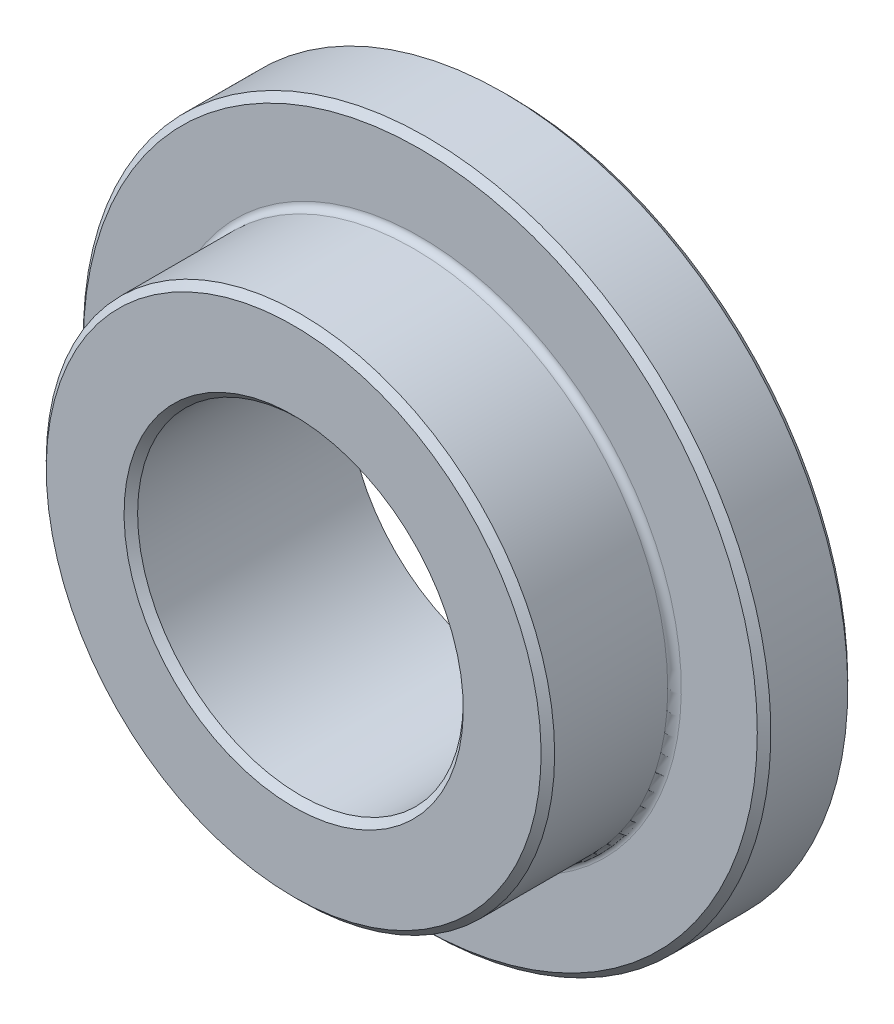
ISO-10303-21;
HEADER;
FILE_DESCRIPTION(('STEP AP214'),'2;1');
FILE_NAME('part.step','',(''),(''),'','','');
FILE_SCHEMA(('AUTOMOTIVE_DESIGN { 1 0 10303 214 1 1 1 1 }'));
ENDSEC;
DATA;
#1=APPLICATION_CONTEXT('core data for automotive mechanical design processes');
#2=APPLICATION_PROTOCOL_DEFINITION('international standard','automotive_design',2000,#1);
#3=PRODUCT_CONTEXT('',#1,'mechanical');
#4=PRODUCT('Part','Part','',(#3));
#5=PRODUCT_RELATED_PRODUCT_CATEGORY('part','',(#4));
#6=PRODUCT_DEFINITION_FORMATION('','',#4);
#7=PRODUCT_DEFINITION_CONTEXT('part definition',#1,'design');
#8=PRODUCT_DEFINITION('design','',#6,#7);
#9=PRODUCT_DEFINITION_SHAPE('','',#8);
#10=(LENGTH_UNIT() NAMED_UNIT(*) SI_UNIT(.MILLI.,.METRE.));
#11=(NAMED_UNIT(*) PLANE_ANGLE_UNIT() SI_UNIT($,.RADIAN.));
#12=(NAMED_UNIT(*) SI_UNIT($,.STERADIAN.) SOLID_ANGLE_UNIT());
#13=UNCERTAINTY_MEASURE_WITH_UNIT(LENGTH_MEASURE(1.E-05),#10,'distance_accuracy_value','');
#14=(GEOMETRIC_REPRESENTATION_CONTEXT(3) GLOBAL_UNCERTAINTY_ASSIGNED_CONTEXT((#13)) GLOBAL_UNIT_ASSIGNED_CONTEXT((#10,
#11,#12)) REPRESENTATION_CONTEXT('',''));
#15=CARTESIAN_POINT('',(0.,0.,0.));
#16=DIRECTION('',(0.,0.,1.));
#17=DIRECTION('',(1.,0.,0.));
#18=AXIS2_PLACEMENT_3D('',#15,#16,#17);
#19=CARTESIAN_POINT('',(0.,9.5,-3.));
#20=DIRECTION('',(0.,0.,-1.));
#21=DIRECTION('',(0.,1.,0.));
#22=AXIS2_PLACEMENT_3D('',#19,#20,#21);
#23=PLANE('',#22);
#24=CARTESIAN_POINT('',(0.,0.,-3.));
#25=DIRECTION('',(0.,0.,-1.));
#26=DIRECTION('',(0.,1.,0.));
#27=AXIS2_PLACEMENT_3D('',#24,#25,#26);
#28=CIRCLE('',#27,9.3125);
#29=CARTESIAN_POINT('',(0.,9.3125,-3.));
#30=VERTEX_POINT('',#29);
#31=EDGE_CURVE('E83',#30,#30,#28,.T.);
#32=ORIENTED_EDGE('',*,*,#31,.T.);
#33=EDGE_LOOP('',(#32));
#34=FACE_BOUND('',#33,.T.);
#35=CARTESIAN_POINT('',(0.,0.,-3.));
#36=DIRECTION('',(0.,0.,-1.));
#37=DIRECTION('',(0.,1.,0.));
#38=AXIS2_PLACEMENT_3D('',#35,#36,#37);
#39=CIRCLE('',#38,4.5);
#40=CARTESIAN_POINT('',(0.,4.5,-3.));
#41=VERTEX_POINT('',#40);
#42=EDGE_CURVE('E87',#41,#41,#39,.T.);
#43=ORIENTED_EDGE('',*,*,#42,.F.);
#44=EDGE_LOOP('',(#43));
#45=FACE_BOUND('',#44,.T.);
#46=ADVANCED_FACE('F39',(#34,#45),#23,.T.);
#47=CARTESIAN_POINT('',(0.,0.,-3.));
#48=DIRECTION('',(0.,0.,-1.));
#49=DIRECTION('',(0.,1.,0.));
#50=AXIS2_PLACEMENT_3D('',#47,#48,#49);
#51=CYLINDRICAL_SURFACE('',#50,9.5);
#52=CARTESIAN_POINT('',(0.,0.,-2.8125));
#53=DIRECTION('',(0.,0.,-1.));
#54=DIRECTION('',(0.,1.,0.));
#55=AXIS2_PLACEMENT_3D('',#52,#53,#54);
#56=CIRCLE('',#55,9.5);
#57=CARTESIAN_POINT('',(0.,9.5,-2.8125));
#58=VERTEX_POINT('',#57);
#59=EDGE_CURVE('E75',#58,#58,#56,.F.);
#60=ORIENTED_EDGE('',*,*,#59,.T.);
#61=EDGE_LOOP('',(#60));
#62=FACE_BOUND('',#61,.T.);
#63=CARTESIAN_POINT('',(0.,0.,-0.687499999999996));
#64=DIRECTION('',(0.,0.,1.));
#65=DIRECTION('',(0.,-1.,0.));
#66=AXIS2_PLACEMENT_3D('',#63,#64,#65);
#67=CIRCLE('',#66,9.5);
#68=CARTESIAN_POINT('',(0.,-9.5,-0.687499999999997));
#69=VERTEX_POINT('',#68);
#70=EDGE_CURVE('E79',#69,#69,#67,.F.);
#71=ORIENTED_EDGE('',*,*,#70,.T.);
#72=EDGE_LOOP('',(#71));
#73=FACE_BOUND('',#72,.T.);
#74=ADVANCED_FACE('F95',(#62,#73),#51,.T.);
#75=CARTESIAN_POINT('',(0.,9.5,-0.499999999999999));
#76=DIRECTION('',(0.,0.,1.));
#77=DIRECTION('',(0.,-1.,0.));
#78=AXIS2_PLACEMENT_3D('',#75,#76,#77);
#79=PLANE('',#78);
#80=CARTESIAN_POINT('',(0.,0.,-0.500000000000001));
#81=DIRECTION('',(0.,0.,1.));
#82=DIRECTION('',(0.,-1.,0.));
#83=AXIS2_PLACEMENT_3D('',#80,#81,#82);
#84=CIRCLE('',#83,7.2125);
#85=CARTESIAN_POINT('',(0.,-7.2125,-0.500000000000002));
#86=VERTEX_POINT('',#85);
#87=EDGE_CURVE('E47',#86,#86,#84,.F.);
#88=ORIENTED_EDGE('',*,*,#87,.T.);
#89=EDGE_LOOP('',(#88));
#90=FACE_BOUND('',#89,.T.);
#91=CARTESIAN_POINT('',(0.,0.,-0.500000000000001));
#92=DIRECTION('',(0.,0.,1.));
#93=DIRECTION('',(0.,-1.,0.));
#94=AXIS2_PLACEMENT_3D('',#91,#92,#93);
#95=CIRCLE('',#94,9.31250000000001);
#96=CARTESIAN_POINT('',(0.,-9.31250000000001,-0.500000000000002));
#97=VERTEX_POINT('',#96);
#98=EDGE_CURVE('E71',#97,#97,#95,.T.);
#99=ORIENTED_EDGE('',*,*,#98,.T.);
#100=EDGE_LOOP('',(#99));
#101=FACE_BOUND('',#100,.T.);
#102=ADVANCED_FACE('F101',(#90,#101),#79,.T.);
#103=CARTESIAN_POINT('',(0.,0.,-3.));
#104=DIRECTION('',(0.,0.,-1.));
#105=DIRECTION('',(0.,1.,0.));
#106=AXIS2_PLACEMENT_3D('',#103,#104,#105);
#107=CYLINDRICAL_SURFACE('',#106,7.025);
#108=CARTESIAN_POINT('',(0.,0.,-0.312500000000001));
#109=DIRECTION('',(0.,0.,1.));
#110=DIRECTION('',(0.,-1.,0.));
#111=AXIS2_PLACEMENT_3D('',#108,#109,#110);
#112=CIRCLE('',#111,7.025);
#113=CARTESIAN_POINT('',(0.,-7.025,-0.312500000000002));
#114=VERTEX_POINT('',#113);
#115=EDGE_CURVE('E10',#114,#114,#112,.T.);
#116=ORIENTED_EDGE('',*,*,#115,.T.);
#117=EDGE_LOOP('',(#116));
#118=FACE_BOUND('',#117,.T.);
#119=CARTESIAN_POINT('',(0.,0.,2.8125));
#120=DIRECTION('',(0.,0.,1.));
#121=DIRECTION('',(0.,-1.,0.));
#122=AXIS2_PLACEMENT_3D('',#119,#120,#121);
#123=CIRCLE('',#122,7.025);
#124=CARTESIAN_POINT('',(0.,-7.025,2.8125));
#125=VERTEX_POINT('',#124);
#126=EDGE_CURVE('E67',#125,#125,#123,.F.);
#127=ORIENTED_EDGE('',*,*,#126,.T.);
#128=EDGE_LOOP('',(#127));
#129=FACE_BOUND('',#128,.T.);
#130=ADVANCED_FACE('F130',(#118,#129),#107,.T.);
#131=CARTESIAN_POINT('',(0.,7.025,3.));
#132=DIRECTION('',(0.,0.,1.));
#133=DIRECTION('',(0.,-1.,0.));
#134=AXIS2_PLACEMENT_3D('',#131,#132,#133);
#135=PLANE('',#134);
#136=CARTESIAN_POINT('',(0.,0.,3.));
#137=DIRECTION('',(0.,0.,1.));
#138=DIRECTION('',(0.,-1.,0.));
#139=AXIS2_PLACEMENT_3D('',#136,#137,#138);
#140=CIRCLE('',#139,6.8375);
#141=CARTESIAN_POINT('',(0.,-6.8375,3.));
#142=VERTEX_POINT('',#141);
#143=EDGE_CURVE('E57',#142,#142,#140,.T.);
#144=ORIENTED_EDGE('',*,*,#143,.T.);
#145=EDGE_LOOP('',(#144));
#146=FACE_BOUND('',#145,.T.);
#147=CARTESIAN_POINT('',(0.,0.,3.));
#148=DIRECTION('',(0.,0.,1.));
#149=DIRECTION('',(0.,-1.,0.));
#150=AXIS2_PLACEMENT_3D('',#147,#148,#149);
#151=CIRCLE('',#150,4.6875);
#152=CARTESIAN_POINT('',(0.,-4.6875,3.));
#153=VERTEX_POINT('',#152);
#154=EDGE_CURVE('E63',#153,#153,#151,.F.);
#155=ORIENTED_EDGE('',*,*,#154,.T.);
#156=EDGE_LOOP('',(#155));
#157=FACE_BOUND('',#156,.T.);
#158=ADVANCED_FACE('F128',(#146,#157),#135,.T.);
#159=CARTESIAN_POINT('',(0.,0.,-3.));
#160=DIRECTION('',(0.,0.,-1.));
#161=DIRECTION('',(0.,1.,0.));
#162=AXIS2_PLACEMENT_3D('',#159,#160,#161);
#163=CYLINDRICAL_SURFACE('',#162,4.5);
#164=CARTESIAN_POINT('',(0.,0.,2.8125));
#165=DIRECTION('',(0.,0.,1.));
#166=DIRECTION('',(0.,-1.,0.));
#167=AXIS2_PLACEMENT_3D('',#164,#165,#166);
#168=CIRCLE('',#167,4.5);
#169=CARTESIAN_POINT('',(0.,-4.5,2.8125));
#170=VERTEX_POINT('',#169);
#171=EDGE_CURVE('E52',#170,#170,#168,.T.);
#172=ORIENTED_EDGE('',*,*,#171,.T.);
#173=EDGE_LOOP('',(#172));
#174=FACE_BOUND('',#173,.T.);
#175=ORIENTED_EDGE('',*,*,#42,.T.);
#176=EDGE_LOOP('',(#175));
#177=FACE_BOUND('',#176,.T.);
#178=ADVANCED_FACE('F92',(#174,#177),#163,.F.);
#179=CARTESIAN_POINT('',(0.,0.,-3.));
#180=DIRECTION('',(0.,0.,1.));
#181=DIRECTION('',(0.,-1.,0.));
#182=AXIS2_PLACEMENT_3D('',#179,#180,#181);
#183=CONICAL_SURFACE('',#182,9.3125,0.785398163397453);
#184=ORIENTED_EDGE('',*,*,#59,.F.);
#185=EDGE_LOOP('',(#184));
#186=FACE_BOUND('',#185,.T.);
#187=ORIENTED_EDGE('',*,*,#31,.F.);
#188=EDGE_LOOP('',(#187));
#189=FACE_BOUND('',#188,.T.);
#190=ADVANCED_FACE('F106',(#186,#189),#183,.T.);
#191=CARTESIAN_POINT('',(0.,0.,-0.687499999999996));
#192=DIRECTION('',(0.,0.,-1.));
#193=DIRECTION('',(0.,1.,0.));
#194=AXIS2_PLACEMENT_3D('',#191,#192,#193);
#195=CONICAL_SURFACE('',#194,9.5,0.785398163397448);
#196=ORIENTED_EDGE('',*,*,#98,.F.);
#197=EDGE_LOOP('',(#196));
#198=FACE_BOUND('',#197,.T.);
#199=ORIENTED_EDGE('',*,*,#70,.F.);
#200=EDGE_LOOP('',(#199));
#201=FACE_BOUND('',#200,.T.);
#202=ADVANCED_FACE('F109',(#198,#201),#195,.T.);
#203=CARTESIAN_POINT('',(0.,0.,2.8125));
#204=DIRECTION('',(0.,0.,-1.));
#205=DIRECTION('',(0.,1.,0.));
#206=AXIS2_PLACEMENT_3D('',#203,#204,#205);
#207=CONICAL_SURFACE('',#206,7.025,0.785398163397453);
#208=ORIENTED_EDGE('',*,*,#143,.F.);
#209=EDGE_LOOP('',(#208));
#210=FACE_BOUND('',#209,.T.);
#211=ORIENTED_EDGE('',*,*,#126,.F.);
#212=EDGE_LOOP('',(#211));
#213=FACE_BOUND('',#212,.T.);
#214=ADVANCED_FACE('F113',(#210,#213),#207,.T.);
#215=CARTESIAN_POINT('',(0.,0.,3.));
#216=DIRECTION('',(0.,0.,1.));
#217=DIRECTION('',(0.,-1.,0.));
#218=AXIS2_PLACEMENT_3D('',#215,#216,#217);
#219=CONICAL_SURFACE('',#218,4.6875,0.785398163397451);
#220=ORIENTED_EDGE('',*,*,#171,.F.);
#221=EDGE_LOOP('',(#220));
#222=FACE_BOUND('',#221,.T.);
#223=ORIENTED_EDGE('',*,*,#154,.F.);
#224=EDGE_LOOP('',(#223));
#225=FACE_BOUND('',#224,.T.);
#226=ADVANCED_FACE('F116',(#222,#225),#219,.F.);
#227=CARTESIAN_POINT('',(0.,0.,-0.312500000000001));
#228=DIRECTION('',(0.,0.,1.));
#229=DIRECTION('',(0.,-1.,0.));
#230=AXIS2_PLACEMENT_3D('',#227,#228,#229);
#231=TOROIDAL_SURFACE('',#230,7.2125,0.1875);
#232=ORIENTED_EDGE('',*,*,#115,.F.);
#233=EDGE_LOOP('',(#232));
#234=FACE_BOUND('',#233,.T.);
#235=ORIENTED_EDGE('',*,*,#87,.F.);
#236=EDGE_LOOP('',(#235));
#237=FACE_BOUND('',#236,.T.);
#238=ADVANCED_FACE('F41',(#234,#237),#231,.F.);
#239=CLOSED_SHELL('',(#46,#74,#102,#130,#158,#178,#190,#202,#214,#226,#238));
#240=MANIFOLD_SOLID_BREP('B2',#239);
#241=ADVANCED_BREP_SHAPE_REPRESENTATION('',(#18,#240),#14);
#242=SHAPE_DEFINITION_REPRESENTATION(#9,#241);
ENDSEC;
END-ISO-10303-21;
